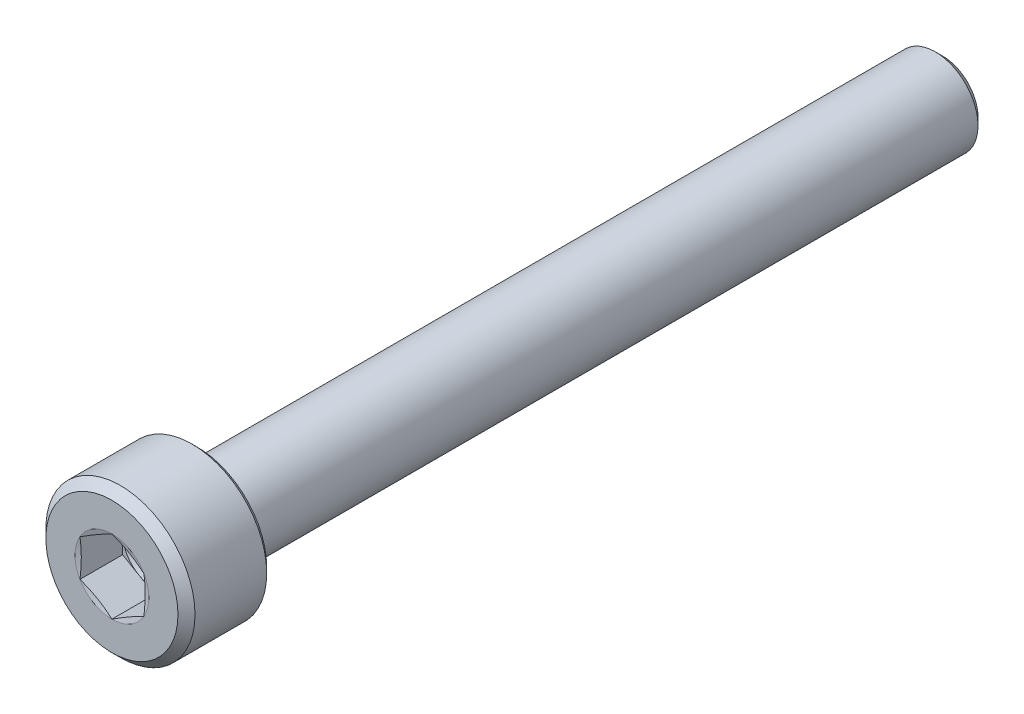
ISO-10303-21;
HEADER;
FILE_DESCRIPTION(('STEP AP214'),'2;1');
FILE_NAME('part.step','',(''),(''),'','','');
FILE_SCHEMA(('AUTOMOTIVE_DESIGN { 1 0 10303 214 1 1 1 1 }'));
ENDSEC;
DATA;
#1=APPLICATION_CONTEXT('core data for automotive mechanical design processes');
#2=APPLICATION_PROTOCOL_DEFINITION('international standard','automotive_design',2000,#1);
#3=PRODUCT_CONTEXT('',#1,'mechanical');
#4=PRODUCT('Part','Part','',(#3));
#5=PRODUCT_RELATED_PRODUCT_CATEGORY('part','',(#4));
#6=PRODUCT_DEFINITION_FORMATION('','',#4);
#7=PRODUCT_DEFINITION_CONTEXT('part definition',#1,'design');
#8=PRODUCT_DEFINITION('design','',#6,#7);
#9=PRODUCT_DEFINITION_SHAPE('','',#8);
#10=(LENGTH_UNIT() NAMED_UNIT(*) SI_UNIT(.MILLI.,.METRE.));
#11=(NAMED_UNIT(*) PLANE_ANGLE_UNIT() SI_UNIT($,.RADIAN.));
#12=(NAMED_UNIT(*) SI_UNIT($,.STERADIAN.) SOLID_ANGLE_UNIT());
#13=UNCERTAINTY_MEASURE_WITH_UNIT(LENGTH_MEASURE(1.E-05),#10,'distance_accuracy_value','');
#14=(GEOMETRIC_REPRESENTATION_CONTEXT(3) GLOBAL_UNCERTAINTY_ASSIGNED_CONTEXT((#13)) GLOBAL_UNIT_ASSIGNED_CONTEXT((#10,
#11,#12)) REPRESENTATION_CONTEXT('',''));
#15=CARTESIAN_POINT('',(0.,0.,0.));
#16=DIRECTION('',(0.,0.,1.));
#17=DIRECTION('',(1.,0.,0.));
#18=AXIS2_PLACEMENT_3D('',#15,#16,#17);
#19=CARTESIAN_POINT('',(0.,0.,0.));
#20=DIRECTION('',(0.,0.,-1.));
#21=DIRECTION('',(-1.,0.,0.));
#22=AXIS2_PLACEMENT_3D('',#19,#20,#21);
#23=PLANE('',#22);
#24=CARTESIAN_POINT('',(0.,0.,0.));
#25=DIRECTION('',(0.,0.,1.));
#26=DIRECTION('',(1.,0.,0.));
#27=AXIS2_PLACEMENT_3D('',#24,#25,#26);
#28=CIRCLE('',#27,3.1);
#29=CARTESIAN_POINT('',(3.1,0.,0.));
#30=VERTEX_POINT('',#29);
#31=EDGE_CURVE('E229',#30,#30,#28,.T.);
#32=ORIENTED_EDGE('',*,*,#31,.T.);
#33=EDGE_LOOP('',(#32));
#34=FACE_BOUND('',#33,.T.);
#35=CARTESIAN_POINT('',(0.,0.,0.));
#36=DIRECTION('',(0.,0.,1.));
#37=DIRECTION('',(1.,0.,0.));
#38=AXIS2_PLACEMENT_3D('',#35,#36,#37);
#39=CIRCLE('',#38,1.73205080756888);
#40=CARTESIAN_POINT('',(-1.5,-0.866025403784441,0.));
#41=VERTEX_POINT('',#40);
#42=CARTESIAN_POINT('',(0.,-1.73205080756888,0.));
#43=VERTEX_POINT('',#42);
#44=EDGE_CURVE('E155',#41,#43,#39,.T.);
#45=ORIENTED_EDGE('',*,*,#44,.F.);
#46=CARTESIAN_POINT('',(-1.5,0.86602540378444,0.));
#47=VERTEX_POINT('',#46);
#48=EDGE_CURVE('E154',#47,#41,#39,.T.);
#49=ORIENTED_EDGE('',*,*,#48,.F.);
#50=CARTESIAN_POINT('',(0.,1.73205080756888,0.));
#51=VERTEX_POINT('',#50);
#52=EDGE_CURVE('E121',#51,#47,#39,.T.);
#53=ORIENTED_EDGE('',*,*,#52,.F.);
#54=CARTESIAN_POINT('',(1.5,0.86602540378444,0.));
#55=VERTEX_POINT('',#54);
#56=EDGE_CURVE('E115',#55,#51,#39,.T.);
#57=ORIENTED_EDGE('',*,*,#56,.F.);
#58=CARTESIAN_POINT('',(1.5,-0.866025403784438,0.));
#59=VERTEX_POINT('',#58);
#60=EDGE_CURVE('E123',#59,#55,#39,.T.);
#61=ORIENTED_EDGE('',*,*,#60,.F.);
#62=EDGE_CURVE('E313',#43,#59,#39,.T.);
#63=ORIENTED_EDGE('',*,*,#62,.F.);
#64=EDGE_LOOP('',(#45,#49,#53,#57,#61,#63));
#65=FACE_BOUND('',#64,.T.);
#66=ADVANCED_FACE('F38',(#34,#65),#23,.F.);
#67=CARTESIAN_POINT('',(0.,0.,-0.4));
#68=DIRECTION('',(0.,0.,-1.));
#69=DIRECTION('',(-1.,0.,0.));
#70=AXIS2_PLACEMENT_3D('',#67,#68,#69);
#71=CONICAL_SURFACE('',#70,3.5,0.78539816339745);
#72=ORIENTED_EDGE('',*,*,#31,.F.);
#73=EDGE_LOOP('',(#72));
#74=FACE_BOUND('',#73,.T.);
#75=CARTESIAN_POINT('',(0.,0.,-0.4));
#76=DIRECTION('',(0.,0.,1.));
#77=DIRECTION('',(1.,0.,0.));
#78=AXIS2_PLACEMENT_3D('',#75,#76,#77);
#79=CIRCLE('',#78,3.5);
#80=CARTESIAN_POINT('',(3.5,0.,-0.4));
#81=VERTEX_POINT('',#80);
#82=EDGE_CURVE('E231',#81,#81,#79,.T.);
#83=ORIENTED_EDGE('',*,*,#82,.T.);
#84=EDGE_LOOP('',(#83));
#85=FACE_BOUND('',#84,.T.);
#86=ADVANCED_FACE('F220',(#74,#85),#71,.T.);
#87=CARTESIAN_POINT('',(0.,0.,0.));
#88=DIRECTION('',(0.,0.,1.));
#89=DIRECTION('',(1.,0.,0.));
#90=AXIS2_PLACEMENT_3D('',#87,#88,#89);
#91=CYLINDRICAL_SURFACE('',#90,3.5);
#92=ORIENTED_EDGE('',*,*,#82,.F.);
#93=EDGE_LOOP('',(#92));
#94=FACE_BOUND('',#93,.T.);
#95=CARTESIAN_POINT('',(0.,0.,-3.765));
#96=DIRECTION('',(0.,0.,1.));
#97=DIRECTION('',(1.,0.,0.));
#98=AXIS2_PLACEMENT_3D('',#95,#96,#97);
#99=CIRCLE('',#98,3.5);
#100=CARTESIAN_POINT('',(3.5,0.,-3.765));
#101=VERTEX_POINT('',#100);
#102=EDGE_CURVE('E234',#101,#101,#99,.T.);
#103=ORIENTED_EDGE('',*,*,#102,.T.);
#104=EDGE_LOOP('',(#103));
#105=FACE_BOUND('',#104,.T.);
#106=ADVANCED_FACE('F225',(#94,#105),#91,.T.);
#107=CARTESIAN_POINT('',(0.,0.,-4.));
#108=DIRECTION('',(0.,0.,1.));
#109=DIRECTION('',(1.,0.,0.));
#110=AXIS2_PLACEMENT_3D('',#107,#108,#109);
#111=CONICAL_SURFACE('',#110,3.265,0.78539816339745);
#112=ORIENTED_EDGE('',*,*,#102,.F.);
#113=EDGE_LOOP('',(#112));
#114=FACE_BOUND('',#113,.T.);
#115=CARTESIAN_POINT('',(0.,0.,-4.));
#116=DIRECTION('',(0.,0.,1.));
#117=DIRECTION('',(1.,0.,0.));
#118=AXIS2_PLACEMENT_3D('',#115,#116,#117);
#119=CIRCLE('',#118,3.265);
#120=CARTESIAN_POINT('',(3.265,0.,-4.));
#121=VERTEX_POINT('',#120);
#122=EDGE_CURVE('E239',#121,#121,#119,.T.);
#123=ORIENTED_EDGE('',*,*,#122,.T.);
#124=EDGE_LOOP('',(#123));
#125=FACE_BOUND('',#124,.T.);
#126=ADVANCED_FACE('F429',(#114,#125),#111,.T.);
#127=CARTESIAN_POINT('',(0.,3.265,-4.));
#128=DIRECTION('',(0.,0.,1.));
#129=DIRECTION('',(1.,0.,0.));
#130=AXIS2_PLACEMENT_3D('',#127,#128,#129);
#131=PLANE('',#130);
#132=ORIENTED_EDGE('',*,*,#122,.F.);
#133=EDGE_LOOP('',(#132));
#134=FACE_BOUND('',#133,.T.);
#135=CARTESIAN_POINT('',(0.,0.,-4.));
#136=DIRECTION('',(0.,0.,1.));
#137=DIRECTION('',(1.,0.,0.));
#138=AXIS2_PLACEMENT_3D('',#135,#136,#137);
#139=CIRCLE('',#138,2.35);
#140=CARTESIAN_POINT('',(2.35,0.,-4.));
#141=VERTEX_POINT('',#140);
#142=EDGE_CURVE('E242',#141,#141,#139,.T.);
#143=ORIENTED_EDGE('',*,*,#142,.T.);
#144=EDGE_LOOP('',(#143));
#145=FACE_BOUND('',#144,.T.);
#146=ADVANCED_FACE('F421',(#134,#145),#131,.F.);
#147=CARTESIAN_POINT('',(0.,0.,-4.2));
#148=DIRECTION('',(0.,0.,1.));
#149=DIRECTION('',(1.,0.,0.));
#150=AXIS2_PLACEMENT_3D('',#147,#148,#149);
#151=TOROIDAL_SURFACE('',#150,2.35,0.199999999999999);
#152=ORIENTED_EDGE('',*,*,#142,.F.);
#153=EDGE_LOOP('',(#152));
#154=FACE_BOUND('',#153,.T.);
#155=CARTESIAN_POINT('',(0.,0.,-4.12977531168232));
#156=DIRECTION('',(0.,0.,1.));
#157=DIRECTION('',(1.,0.,0.));
#158=AXIS2_PLACEMENT_3D('',#155,#156,#157);
#159=CIRCLE('',#158,2.16273416448619);
#160=CARTESIAN_POINT('',(2.16273416448619,0.,-4.12977531168232));
#161=VERTEX_POINT('',#160);
#162=EDGE_CURVE('E245',#161,#161,#159,.T.);
#163=ORIENTED_EDGE('',*,*,#162,.T.);
#164=EDGE_LOOP('',(#163));
#165=FACE_BOUND('',#164,.T.);
#166=ADVANCED_FACE('F413',(#154,#165),#151,.F.);
#167=CARTESIAN_POINT('',(0.,0.,-4.52977531168232));
#168=DIRECTION('',(0.,0.,1.));
#169=DIRECTION('',(1.,0.,0.));
#170=AXIS2_PLACEMENT_3D('',#167,#168,#169);
#171=CONICAL_SURFACE('',#170,2.01273416448619,0.358770670270571);
#172=ORIENTED_EDGE('',*,*,#162,.F.);
#173=EDGE_LOOP('',(#172));
#174=FACE_BOUND('',#173,.T.);
#175=CARTESIAN_POINT('',(0.,0.,-4.52977531168232));
#176=DIRECTION('',(0.,0.,1.));
#177=DIRECTION('',(1.,0.,0.));
#178=AXIS2_PLACEMENT_3D('',#175,#176,#177);
#179=CIRCLE('',#178,2.01273416448619);
#180=CARTESIAN_POINT('',(2.01273416448619,0.,-4.52977531168232));
#181=VERTEX_POINT('',#180);
#182=EDGE_CURVE('E248',#181,#181,#179,.T.);
#183=ORIENTED_EDGE('',*,*,#182,.T.);
#184=EDGE_LOOP('',(#183));
#185=FACE_BOUND('',#184,.T.);
#186=ADVANCED_FACE('F405',(#174,#185),#171,.T.);
#187=CARTESIAN_POINT('',(0.,0.,-4.6));
#188=DIRECTION('',(0.,0.,1.));
#189=DIRECTION('',(1.,0.,0.));
#190=AXIS2_PLACEMENT_3D('',#187,#188,#189);
#191=TOROIDAL_SURFACE('',#190,2.2,0.199999999999999);
#192=ORIENTED_EDGE('',*,*,#182,.F.);
#193=EDGE_LOOP('',(#192));
#194=FACE_BOUND('',#193,.T.);
#195=CARTESIAN_POINT('',(0.,0.,-4.6));
#196=DIRECTION('',(0.,0.,1.));
#197=DIRECTION('',(1.,0.,0.));
#198=AXIS2_PLACEMENT_3D('',#195,#196,#197);
#199=CIRCLE('',#198,2.);
#200=CARTESIAN_POINT('',(2.,0.,-4.6));
#201=VERTEX_POINT('',#200);
#202=EDGE_CURVE('E251',#201,#201,#199,.T.);
#203=ORIENTED_EDGE('',*,*,#202,.T.);
#204=EDGE_LOOP('',(#203));
#205=FACE_BOUND('',#204,.T.);
#206=ADVANCED_FACE('F397',(#194,#205),#191,.F.);
#207=CARTESIAN_POINT('',(0.,0.,0.));
#208=DIRECTION('',(0.,0.,1.));
#209=DIRECTION('',(1.,0.,0.));
#210=AXIS2_PLACEMENT_3D('',#207,#208,#209);
#211=CYLINDRICAL_SURFACE('',#210,2.);
#212=ORIENTED_EDGE('',*,*,#202,.F.);
#213=EDGE_LOOP('',(#212));
#214=FACE_BOUND('',#213,.T.);
#215=CARTESIAN_POINT('',(0.,0.,-38.65));
#216=DIRECTION('',(0.,0.,1.));
#217=DIRECTION('',(1.,0.,0.));
#218=AXIS2_PLACEMENT_3D('',#215,#216,#217);
#219=CIRCLE('',#218,2.);
#220=CARTESIAN_POINT('',(2.,0.,-38.65));
#221=VERTEX_POINT('',#220);
#222=EDGE_CURVE('E254',#221,#221,#219,.T.);
#223=ORIENTED_EDGE('',*,*,#222,.T.);
#224=EDGE_LOOP('',(#223));
#225=FACE_BOUND('',#224,.T.);
#226=ADVANCED_FACE('F388',(#214,#225),#211,.T.);
#227=CARTESIAN_POINT('',(0.,0.,-39.));
#228=DIRECTION('',(0.,0.,1.));
#229=DIRECTION('',(1.,0.,0.));
#230=AXIS2_PLACEMENT_3D('',#227,#228,#229);
#231=CONICAL_SURFACE('',#230,1.65,0.785398163397444);
#232=ORIENTED_EDGE('',*,*,#222,.F.);
#233=EDGE_LOOP('',(#232));
#234=FACE_BOUND('',#233,.T.);
#235=CARTESIAN_POINT('',(0.,0.,-39.));
#236=DIRECTION('',(0.,0.,1.));
#237=DIRECTION('',(1.,0.,0.));
#238=AXIS2_PLACEMENT_3D('',#235,#236,#237);
#239=CIRCLE('',#238,1.65);
#240=CARTESIAN_POINT('',(1.65,0.,-39.));
#241=VERTEX_POINT('',#240);
#242=EDGE_CURVE('E257',#241,#241,#239,.T.);
#243=ORIENTED_EDGE('',*,*,#242,.T.);
#244=EDGE_LOOP('',(#243));
#245=FACE_BOUND('',#244,.T.);
#246=ADVANCED_FACE('F380',(#234,#245),#231,.T.);
#247=CARTESIAN_POINT('',(0.,1.65,-39.));
#248=DIRECTION('',(0.,0.,1.));
#249=DIRECTION('',(1.,0.,0.));
#250=AXIS2_PLACEMENT_3D('',#247,#248,#249);
#251=PLANE('',#250);
#252=ORIENTED_EDGE('',*,*,#242,.F.);
#253=EDGE_LOOP('',(#252));
#254=FACE_BOUND('',#253,.T.);
#255=ADVANCED_FACE('F374',(#254),#251,.F.);
#256=CARTESIAN_POINT('',(0.,0.,-0.0621778264910692));
#257=DIRECTION('',(0.,0.,1.));
#258=DIRECTION('',(1.,0.,0.));
#259=AXIS2_PLACEMENT_3D('',#256,#257,#258);
#260=CONICAL_SURFACE('',#259,1.5,1.30899693899575);
#261=ORIENTED_EDGE('',*,*,#52,.T.);
#262=CARTESIAN_POINT('',(-1.5002,0.865909933730602,3.09432014802828E-05));
#263=CARTESIAN_POINT('',(-1.43789222061942,0.901883346928587,-0.00961367357160753));
#264=CARTESIAN_POINT('',(-1.37547144481682,0.937921998641243,-0.0183695040280942));
#265=CARTESIAN_POINT('',(-1.25040937601299,1.01012661773055,-0.0337528099860755));
#266=CARTESIAN_POINT('',(-1.18776800380528,1.04629263083708,-0.0403794203637019));
#267=CARTESIAN_POINT('',(-1.06264466889024,1.11853262193218,-0.0511173105510228));
#268=CARTESIAN_POINT('',(-1.00016355288116,1.15460611107929,-0.0552413999954297));
#269=CARTESIAN_POINT('',(-0.875121612727221,1.22679910888716,-0.0607713948192355));
#270=CARTESIAN_POINT('',(-0.81256080636361,1.26291860728191,-0.0621778264910689));
#271=CARTESIAN_POINT('',(-0.687439193636389,1.33515760407141,-0.0621778264910689));
#272=CARTESIAN_POINT('',(-0.624878387272779,1.37127710246616,-0.0607713948192355));
#273=CARTESIAN_POINT('',(-0.499836447118839,1.44347010027403,-0.0552413999954297));
#274=CARTESIAN_POINT('',(-0.437355331109757,1.47954358942114,-0.0511173105510227));
#275=CARTESIAN_POINT('',(-0.312231996194721,1.55178358051624,-0.0403794203637018));
#276=CARTESIAN_POINT('',(-0.249590623987014,1.58794959362277,-0.0337528099860754));
#277=CARTESIAN_POINT('',(-0.124528555183177,1.66015421271208,-0.0183695040280941));
#278=CARTESIAN_POINT('',(-0.0621077793805777,1.69619286442473,-0.00961367357160735));
#279=CARTESIAN_POINT('',(0.000200000000000538,1.73216627762272,3.09432014804724E-05));
#280=B_SPLINE_CURVE_WITH_KNOTS('',3,(#262,#263,#264,#265,#266,#267,#268,#269,#270,#271,#272,
#273,#274,#275,#276,#277,#278,#279),.UNSPECIFIED.,.F.,.F.,(4,2,2,2,2,2,2,2,4),(0.,
0.217782584290281,0.435653544301782,0.652399669875338,0.869103816917188,1.08580796395904,
1.30255408953259,1.52042504954409,1.73820763383438),.UNSPECIFIED.);
#281=EDGE_CURVE('E11',#47,#51,#280,.T.);
#282=ORIENTED_EDGE('',*,*,#281,.T.);
#283=EDGE_LOOP('',(#261,#282));
#284=FACE_BOUND('',#283,.T.);
#285=ADVANCED_FACE('F127',(#284),#260,.F.);
#286=CARTESIAN_POINT('',(-1.5,-2.28964517247226,0.269339250493358));
#287=CARTESIAN_POINT('',(-1.5,-2.22160925580753,0.254092485074887));
#288=CARTESIAN_POINT('',(-1.5,-2.15353089636947,0.239034964401491));
#289=CARTESIAN_POINT('',(-1.5,-2.01726808230002,0.209394014326251));
#290=CARTESIAN_POINT('',(-1.5,-1.94908362321089,0.194810605440343));
#291=CARTESIAN_POINT('',(-1.5,-1.74421629402713,0.15188930467263));
#292=CARTESIAN_POINT('',(-1.5,-1.60735081315243,0.124410160848443));
#293=CARTESIAN_POINT('',(-1.5,-1.33404872260703,0.0731505368877311));
#294=CARTESIAN_POINT('',(-1.5,-1.19761743420633,0.0493422393460058));
#295=CARTESIAN_POINT('',(-1.5,-0.923938172131804,0.00699912407182039));
#296=CARTESIAN_POINT('',(-1.5,-0.786690344875856,-0.0115366116465929));
#297=CARTESIAN_POINT('',(-1.5,-0.509744520865001,-0.0409708681025398));
#298=CARTESIAN_POINT('',(-1.5,-0.370036362636702,-0.0517807181835124));
#299=CARTESIAN_POINT('',(-1.5,-0.160199252563518,-0.0603214648098066));
#300=CARTESIAN_POINT('',(-1.5,-0.0902193139362214,-0.0618897497676771));
#301=CARTESIAN_POINT('',(-1.5,0.049751791494376,-0.0623927733659913));
#302=CARTESIAN_POINT('',(-1.5,0.119742958288953,-0.0613275140426648));
#303=CARTESIAN_POINT('',(-1.5,0.259888881116302,-0.0566175514896631));
#304=CARTESIAN_POINT('',(-1.5,0.330043318264885,-0.0529635706300794));
#305=CARTESIAN_POINT('',(-1.5,0.470190940626507,-0.0432854694959674));
#306=CARTESIAN_POINT('',(-1.5,0.540184111252621,-0.0372611426780542));
#307=CARTESIAN_POINT('',(-1.5,0.749926987666925,-0.0160904435214203));
#308=CARTESIAN_POINT('',(-1.5,0.88936353865627,0.0021504551344671));
#309=CARTESIAN_POINT('',(-1.5,1.15801626262229,0.042848348608772));
#310=CARTESIAN_POINT('',(-1.5,1.28729075030016,0.0649405727898832));
#311=CARTESIAN_POINT('',(-1.5,1.54524807848696,0.11239508941207));
#312=CARTESIAN_POINT('',(-1.5,1.67393084218421,0.137757794638382));
#313=CARTESIAN_POINT('',(-1.5,1.9308654649173,0.190676592918979));
#314=CARTESIAN_POINT('',(-1.5,2.05911723183815,0.218233127195528));
#315=CARTESIAN_POINT('',(-1.5,2.31529096225887,0.274842718879562));
#316=CARTESIAN_POINT('',(-1.5,2.44321291887911,0.303895807243219));
#317=CARTESIAN_POINT('',(-1.5,2.69755167278246,0.362760576516848));
#318=CARTESIAN_POINT('',(-1.5,2.82397086776101,0.392561944472507));
#319=CARTESIAN_POINT('',(-1.5,3.07663292781285,0.452911245733353));
#320=CARTESIAN_POINT('',(-1.5,3.20287578964328,0.483459192582276));
#321=CARTESIAN_POINT('',(-1.5,3.45507130559321,0.545068721241145));
#322=CARTESIAN_POINT('',(-1.5,3.58102412567918,0.576129625174751));
#323=CARTESIAN_POINT('',(-1.5,3.83282000513678,0.638675885363819));
#324=CARTESIAN_POINT('',(-1.5,3.95866306798554,0.670161227611327));
#325=CARTESIAN_POINT('',(-1.5,4.08446786908827,0.70179695066207));
#326=B_SPLINE_CURVE_WITH_KNOTS('',3,(#286,#287,#288,#289,#290,#291,#292,#293,#294,#295,#296,
#297,#298,#299,#300,#301,#302,#303,#304,#305,#306,#307,#308,#309,#310,#311,#312,#313,#314,#315,
#316,#317,#318,#319,#320,#321,#322,#323,#324,#325),.UNSPECIFIED.,.F.,.F.,(4,2,2,2,2,2,2,2,2,2,2,
2,2,2,2,2,2,2,2,4),(0.,0.209169579296721,0.418348197839629,0.837109447697196,1.25252230864062,
1.66786279927901,2.08789680755374,2.29784449547574,2.50779202106835,2.71849580165408,
2.92921794627363,3.35089158040197,3.74428720392395,4.13773252874107,4.53125718404496,
4.92478998266471,5.31443997631384,5.70409704388357,6.09327490648975,6.48243995615359),.UNSPECIFIED.);
#327=EDGE_CURVE('E120',#41,#47,#326,.T.);
#328=ORIENTED_EDGE('',*,*,#327,.T.);
#329=ORIENTED_EDGE('',*,*,#48,.T.);
#330=EDGE_LOOP('',(#328,#329));
#331=FACE_BOUND('',#330,.T.);
#332=ADVANCED_FACE('F361',(#331),#260,.F.);
#333=CARTESIAN_POINT('',(0.000199999999999819,-1.73216627762271,3.09432014800229E-05));
#334=CARTESIAN_POINT('',(-0.0621077793805785,-1.69619286442473,-0.00961367357160781));
#335=CARTESIAN_POINT('',(-0.124528555183178,-1.66015421271207,-0.0183695040280945));
#336=CARTESIAN_POINT('',(-0.249590623987014,-1.58794959362277,-0.0337528099860759));
#337=CARTESIAN_POINT('',(-0.312231996194721,-1.55178358051624,-0.0403794203637023));
#338=CARTESIAN_POINT('',(-0.437355331109758,-1.47954358942114,-0.0511173105510232));
#339=CARTESIAN_POINT('',(-0.499836447118839,-1.44347010027403,-0.0552413999954301));
#340=CARTESIAN_POINT('',(-0.624878387272779,-1.37127710246616,-0.0607713948192359));
#341=CARTESIAN_POINT('',(-0.68743919363639,-1.33515760407141,-0.0621778264910694));
#342=CARTESIAN_POINT('',(-0.81256080636361,-1.26291860728191,-0.0621778264910694));
#343=CARTESIAN_POINT('',(-0.875121612727221,-1.22679910888716,-0.0607713948192359));
#344=CARTESIAN_POINT('',(-1.00016355288116,-1.15460611107929,-0.0552413999954301));
#345=CARTESIAN_POINT('',(-1.06264466889024,-1.11853262193217,-0.0511173105510231));
#346=CARTESIAN_POINT('',(-1.18776800380528,-1.04629263083707,-0.0403794203637023));
#347=CARTESIAN_POINT('',(-1.25040937601299,-1.01012661773055,-0.0337528099860759));
#348=CARTESIAN_POINT('',(-1.37547144481682,-0.937921998641241,-0.0183695040280945));
#349=CARTESIAN_POINT('',(-1.43789222061942,-0.901883346928585,-0.00961367357160784));
#350=CARTESIAN_POINT('',(-1.5002,-0.8659099337306,3.09432014799995E-05));
#351=B_SPLINE_CURVE_WITH_KNOTS('',3,(#333,#334,#335,#336,#337,#338,#339,#340,#341,#342,#343,
#344,#345,#346,#347,#348,#349,#350),.UNSPECIFIED.,.F.,.F.,(4,2,2,2,2,2,2,2,4),(0.,
0.217782584290281,0.435653544301782,0.652399669875338,0.869103816917187,1.08580796395904,
1.30255408953259,1.52042504954409,1.73820763383437),.UNSPECIFIED.);
#352=EDGE_CURVE('E163',#43,#41,#351,.T.);
#353=ORIENTED_EDGE('',*,*,#352,.T.);
#354=ORIENTED_EDGE('',*,*,#44,.T.);
#355=EDGE_LOOP('',(#353,#354));
#356=FACE_BOUND('',#355,.T.);
#357=ADVANCED_FACE('F355',(#356),#260,.F.);
#358=CARTESIAN_POINT('',(1.5002,-0.865909933730601,3.09432014800545E-05));
#359=CARTESIAN_POINT('',(1.43789222061942,-0.901883346928586,-0.00961367357160779));
#360=CARTESIAN_POINT('',(1.37547144481682,-0.937921998641241,-0.0183695040280945));
#361=CARTESIAN_POINT('',(1.25040937601299,-1.01012661773055,-0.0337528099860758));
#362=CARTESIAN_POINT('',(1.18776800380528,-1.04629263083708,-0.0403794203637023));
#363=CARTESIAN_POINT('',(1.06264466889024,-1.11853262193217,-0.0511173105510231));
#364=CARTESIAN_POINT('',(1.00016355288116,-1.15460611107929,-0.0552413999954301));
#365=CARTESIAN_POINT('',(0.875121612727221,-1.22679910888716,-0.0607713948192359));
#366=CARTESIAN_POINT('',(0.81256080636361,-1.26291860728191,-0.0621778264910693));
#367=CARTESIAN_POINT('',(0.687439193636389,-1.33515760407141,-0.0621778264910693));
#368=CARTESIAN_POINT('',(0.624878387272779,-1.37127710246616,-0.0607713948192359));
#369=CARTESIAN_POINT('',(0.499836447118839,-1.44347010027403,-0.0552413999954301));
#370=CARTESIAN_POINT('',(0.437355331109758,-1.47954358942114,-0.0511173105510231));
#371=CARTESIAN_POINT('',(0.312231996194721,-1.55178358051624,-0.0403794203637023));
#372=CARTESIAN_POINT('',(0.249590623987014,-1.58794959362277,-0.0337528099860758));
#373=CARTESIAN_POINT('',(0.124528555183178,-1.66015421271207,-0.0183695040280946));
#374=CARTESIAN_POINT('',(0.0621077793805782,-1.69619286442473,-0.00961367357160789));
#375=CARTESIAN_POINT('',(-0.000200000000000048,-1.73216627762271,3.09432014798939E-05));
#376=B_SPLINE_CURVE_WITH_KNOTS('',3,(#358,#359,#360,#361,#362,#363,#364,#365,#366,#367,#368,
#369,#370,#371,#372,#373,#374,#375),.UNSPECIFIED.,.F.,.F.,(4,2,2,2,2,2,2,2,4),(0.,
0.217782584290281,0.435653544301782,0.652399669875337,0.869103816917187,1.08580796395904,
1.30255408953259,1.52042504954409,1.73820763383437),.UNSPECIFIED.);
#377=EDGE_CURVE('E183',#59,#43,#376,.T.);
#378=ORIENTED_EDGE('',*,*,#377,.T.);
#379=ORIENTED_EDGE('',*,*,#62,.T.);
#380=EDGE_LOOP('',(#378,#379));
#381=FACE_BOUND('',#380,.T.);
#382=ADVANCED_FACE('F349',(#381),#260,.F.);
#383=CARTESIAN_POINT('',(1.5,-2.28964517247227,0.269339250493358));
#384=CARTESIAN_POINT('',(1.5,-2.22160925580753,0.254092485074887));
#385=CARTESIAN_POINT('',(1.5,-2.15353089636947,0.239034964401491));
#386=CARTESIAN_POINT('',(1.5,-2.01726808230003,0.209394014326251));
#387=CARTESIAN_POINT('',(1.5,-1.94908362321089,0.194810605440343));
#388=CARTESIAN_POINT('',(1.5,-1.74421629402713,0.15188930467263));
#389=CARTESIAN_POINT('',(1.5,-1.60735081315243,0.124410160848443));
#390=CARTESIAN_POINT('',(1.5,-1.33404872260703,0.0731505368877311));
#391=CARTESIAN_POINT('',(1.5,-1.19761743420633,0.0493422393460058));
#392=CARTESIAN_POINT('',(1.5,-0.923938172131805,0.00699912407182037));
#393=CARTESIAN_POINT('',(1.5,-0.786690344875857,-0.0115366116465929));
#394=CARTESIAN_POINT('',(1.5,-0.509744520865002,-0.0409708681025397));
#395=CARTESIAN_POINT('',(1.5,-0.370036362636703,-0.0517807181835124));
#396=CARTESIAN_POINT('',(1.5,-0.160199252563519,-0.0603214648098066));
#397=CARTESIAN_POINT('',(1.5,-0.0902193139362225,-0.0618897497676772));
#398=CARTESIAN_POINT('',(1.5,0.049751791494375,-0.0623927733659914));
#399=CARTESIAN_POINT('',(1.5,0.119742958288952,-0.0613275140426649));
#400=CARTESIAN_POINT('',(1.5,0.259888881116301,-0.0566175514896632));
#401=CARTESIAN_POINT('',(1.5,0.330043318264884,-0.0529635706300795));
#402=CARTESIAN_POINT('',(1.5,0.470190940626506,-0.0432854694959675));
#403=CARTESIAN_POINT('',(1.5,0.54018411125262,-0.0372611426780543));
#404=CARTESIAN_POINT('',(1.5,0.749926987666924,-0.0160904435214204));
#405=CARTESIAN_POINT('',(1.5,0.889363538656269,0.00215045513446702));
#406=CARTESIAN_POINT('',(1.5,1.15801626262229,0.0428483486087719));
#407=CARTESIAN_POINT('',(1.5,1.28729075030016,0.0649405727898832));
#408=CARTESIAN_POINT('',(1.5,1.54524807848696,0.11239508941207));
#409=CARTESIAN_POINT('',(1.5,1.67393084218421,0.137757794638382));
#410=CARTESIAN_POINT('',(1.5,1.9308654649173,0.19067659291898));
#411=CARTESIAN_POINT('',(1.5,2.05911723183815,0.218233127195528));
#412=CARTESIAN_POINT('',(1.5,2.31529096225887,0.274842718879562));
#413=CARTESIAN_POINT('',(1.5,2.44321291887912,0.303895807243219));
#414=CARTESIAN_POINT('',(1.5,2.69755167278246,0.362760576516849));
#415=CARTESIAN_POINT('',(1.5,2.82397086776101,0.392561944472508));
#416=CARTESIAN_POINT('',(1.5,3.07663292781285,0.452911245733354));
#417=CARTESIAN_POINT('',(1.5,3.20287578964328,0.483459192582276));
#418=CARTESIAN_POINT('',(1.5,3.45507130559321,0.545068721241145));
#419=CARTESIAN_POINT('',(1.5,3.58102412567918,0.576129625174751));
#420=CARTESIAN_POINT('',(1.5,3.83282000513678,0.63867588536382));
#421=CARTESIAN_POINT('',(1.5,3.95866306798554,0.670161227611328));
#422=CARTESIAN_POINT('',(1.5,4.08446786908828,0.70179695066207));
#423=B_SPLINE_CURVE_WITH_KNOTS('',3,(#383,#384,#385,#386,#387,#388,#389,#390,#391,#392,#393,
#394,#395,#396,#397,#398,#399,#400,#401,#402,#403,#404,#405,#406,#407,#408,#409,#410,#411,#412,
#413,#414,#415,#416,#417,#418,#419,#420,#421,#422),.UNSPECIFIED.,.F.,.F.,(4,2,2,2,2,2,2,2,2,2,2,
2,2,2,2,2,2,2,2,4),(0.,0.209169579296721,0.418348197839629,0.837109447697197,1.25252230864062,
1.66786279927901,2.08789680755374,2.29784449547574,2.50779202106835,2.71849580165408,
2.92921794627363,3.35089158040197,3.74428720392395,4.13773252874107,4.53125718404496,
4.92478998266471,5.31443997631385,5.70409704388357,6.09327490648975,6.48243995615359),.UNSPECIFIED.);
#424=EDGE_CURVE('E63',#55,#59,#423,.F.);
#425=ORIENTED_EDGE('',*,*,#424,.T.);
#426=ORIENTED_EDGE('',*,*,#60,.T.);
#427=EDGE_LOOP('',(#425,#426));
#428=FACE_BOUND('',#427,.T.);
#429=ADVANCED_FACE('F176',(#428),#260,.F.);
#430=CARTESIAN_POINT('',(-0.000199999999999667,1.73216627762272,3.09432014804973E-05));
#431=CARTESIAN_POINT('',(0.0621077793805787,1.69619286442473,-0.0096136735716074));
#432=CARTESIAN_POINT('',(0.124528555183178,1.66015421271208,-0.0183695040280941));
#433=CARTESIAN_POINT('',(0.249590623987014,1.58794959362277,-0.0337528099860754));
#434=CARTESIAN_POINT('',(0.312231996194721,1.55178358051624,-0.0403794203637018));
#435=CARTESIAN_POINT('',(0.437355331109758,1.47954358942114,-0.0511173105510226));
#436=CARTESIAN_POINT('',(0.499836447118839,1.44347010027403,-0.0552413999954297));
#437=CARTESIAN_POINT('',(0.624878387272779,1.37127710246616,-0.0607713948192354));
#438=CARTESIAN_POINT('',(0.68743919363639,1.33515760407141,-0.0621778264910688));
#439=CARTESIAN_POINT('',(0.812560806363611,1.26291860728191,-0.0621778264910688));
#440=CARTESIAN_POINT('',(0.875121612727221,1.22679910888716,-0.0607713948192354));
#441=CARTESIAN_POINT('',(1.00016355288116,1.15460611107929,-0.0552413999954297));
#442=CARTESIAN_POINT('',(1.06264466889024,1.11853262193218,-0.0511173105510227));
#443=CARTESIAN_POINT('',(1.18776800380528,1.04629263083708,-0.0403794203637019));
#444=CARTESIAN_POINT('',(1.25040937601299,1.01012661773055,-0.0337528099860755));
#445=CARTESIAN_POINT('',(1.37547144481682,0.937921998641243,-0.0183695040280941));
#446=CARTESIAN_POINT('',(1.43789222061942,0.901883346928587,-0.00961367357160743));
#447=CARTESIAN_POINT('',(1.5002,0.865909933730602,3.09432014803357E-05));
#448=B_SPLINE_CURVE_WITH_KNOTS('',3,(#430,#431,#432,#433,#434,#435,#436,#437,#438,#439,#440,
#441,#442,#443,#444,#445,#446,#447),.UNSPECIFIED.,.F.,.F.,(4,2,2,2,2,2,2,2,4),(0.,
0.217782584290281,0.435653544301782,0.652399669875338,0.869103816917187,1.08580796395904,
1.30255408953259,1.52042504954409,1.73820763383437),.UNSPECIFIED.);
#449=EDGE_CURVE('E57',#51,#55,#448,.T.);
#450=ORIENTED_EDGE('',*,*,#449,.T.);
#451=ORIENTED_EDGE('',*,*,#56,.T.);
#452=EDGE_LOOP('',(#450,#451));
#453=FACE_BOUND('',#452,.T.);
#454=ADVANCED_FACE('F116',(#453),#260,.F.);
#455=CARTESIAN_POINT('',(0.,0.,-2.86602540378443));
#456=DIRECTION('',(0.,0.,1.));
#457=DIRECTION('',(1.,0.,0.));
#458=AXIS2_PLACEMENT_3D('',#455,#456,#457);
#459=CONICAL_SURFACE('',#458,0.,1.0471975511966);
#460=CARTESIAN_POINT('',(0.,0.,-2.));
#461=DIRECTION('',(0.,0.,1.));
#462=DIRECTION('',(1.,0.,0.));
#463=AXIS2_PLACEMENT_3D('',#460,#461,#462);
#464=CIRCLE('',#463,1.5);
#465=CARTESIAN_POINT('',(1.5,0.,-2.));
#466=VERTEX_POINT('',#465);
#467=CARTESIAN_POINT('',(0.75,1.29903810567666,-2.));
#468=VERTEX_POINT('',#467);
#469=EDGE_CURVE('E143',#466,#468,#464,.T.);
#470=ORIENTED_EDGE('',*,*,#469,.T.);
#471=CARTESIAN_POINT('',(-0.75,1.29903810567666,-2.));
#472=VERTEX_POINT('',#471);
#473=EDGE_CURVE('E51',#468,#472,#464,.T.);
#474=ORIENTED_EDGE('',*,*,#473,.T.);
#475=CARTESIAN_POINT('',(-1.5,0.,-2.));
#476=VERTEX_POINT('',#475);
#477=EDGE_CURVE('E294',#472,#476,#464,.T.);
#478=ORIENTED_EDGE('',*,*,#477,.T.);
#479=CARTESIAN_POINT('',(-0.75,-1.29903810567666,-2.));
#480=VERTEX_POINT('',#479);
#481=EDGE_CURVE('E296',#476,#480,#464,.T.);
#482=ORIENTED_EDGE('',*,*,#481,.T.);
#483=CARTESIAN_POINT('',(0.749999999999999,-1.29903810567666,-2.));
#484=VERTEX_POINT('',#483);
#485=EDGE_CURVE('E232',#480,#484,#464,.T.);
#486=ORIENTED_EDGE('',*,*,#485,.T.);
#487=EDGE_CURVE('E230',#484,#466,#464,.T.);
#488=ORIENTED_EDGE('',*,*,#487,.T.);
#489=EDGE_LOOP('',(#470,#474,#478,#482,#486,#488));
#490=FACE_BOUND('',#489,.T.);
#491=CARTESIAN_POINT('',(0.,0.,-2.86602540378443));
#492=VERTEX_POINT('',#491);
#493=VERTEX_LOOP('',#492);
#494=FACE_BOUND('',#493,.T.);
#495=ADVANCED_FACE('F175',(#490,#494),#459,.F.);
#496=CARTESIAN_POINT('',(0.,0.,-2.));
#497=DIRECTION('',(0.,0.,1.));
#498=DIRECTION('',(1.,0.,0.));
#499=AXIS2_PLACEMENT_3D('',#496,#497,#498);
#500=PLANE('',#499);
#501=ORIENTED_EDGE('',*,*,#469,.F.);
#502=DIRECTION('',(0.,1.,0.));
#503=VECTOR('',#502,1.);
#504=CARTESIAN_POINT('',(1.5,-0.866025403784439,-2.));
#505=LINE('',#504,#503);
#506=CARTESIAN_POINT('',(1.5,0.86602540378444,-2.));
#507=VERTEX_POINT('',#506);
#508=EDGE_CURVE('E273',#466,#507,#505,.T.);
#509=ORIENTED_EDGE('',*,*,#508,.T.);
#510=DIRECTION('',(-0.866025403784439,0.5,0.));
#511=VECTOR('',#510,1.);
#512=CARTESIAN_POINT('',(1.5,0.86602540378444,-2.));
#513=LINE('',#512,#511);
#514=EDGE_CURVE('E288',#507,#468,#513,.T.);
#515=ORIENTED_EDGE('',*,*,#514,.T.);
#516=EDGE_LOOP('',(#501,#509,#515));
#517=FACE_BOUND('',#516,.T.);
#518=ADVANCED_FACE('F318',(#517),#500,.T.);
#519=ORIENTED_EDGE('',*,*,#487,.F.);
#520=DIRECTION('',(0.866025403784439,0.5,0.));
#521=VECTOR('',#520,1.);
#522=CARTESIAN_POINT('',(0.,-1.73205080756888,-2.));
#523=LINE('',#522,#521);
#524=CARTESIAN_POINT('',(1.5,-0.866025403784439,-2.));
#525=VERTEX_POINT('',#524);
#526=EDGE_CURVE('E277',#484,#525,#523,.T.);
#527=ORIENTED_EDGE('',*,*,#526,.T.);
#528=EDGE_CURVE('E150',#525,#466,#505,.T.);
#529=ORIENTED_EDGE('',*,*,#528,.T.);
#530=EDGE_LOOP('',(#519,#527,#529));
#531=FACE_BOUND('',#530,.T.);
#532=ADVANCED_FACE('F206',(#531),#500,.T.);
#533=ORIENTED_EDGE('',*,*,#485,.F.);
#534=DIRECTION('',(0.866025403784439,-0.5,0.));
#535=VECTOR('',#534,1.);
#536=CARTESIAN_POINT('',(-1.5,-0.866025403784438,-2.));
#537=LINE('',#536,#535);
#538=CARTESIAN_POINT('',(0.,-1.73205080756888,-2.));
#539=VERTEX_POINT('',#538);
#540=EDGE_CURVE('E281',#480,#539,#537,.T.);
#541=ORIENTED_EDGE('',*,*,#540,.T.);
#542=EDGE_CURVE('E274',#539,#484,#523,.T.);
#543=ORIENTED_EDGE('',*,*,#542,.T.);
#544=EDGE_LOOP('',(#533,#541,#543));
#545=FACE_BOUND('',#544,.T.);
#546=ADVANCED_FACE('F309',(#545),#500,.T.);
#547=ORIENTED_EDGE('',*,*,#481,.F.);
#548=DIRECTION('',(0.,-1.,0.));
#549=VECTOR('',#548,1.);
#550=CARTESIAN_POINT('',(-1.5,0.86602540378444,-2.));
#551=LINE('',#550,#549);
#552=CARTESIAN_POINT('',(-1.5,-0.866025403784438,-2.));
#553=VERTEX_POINT('',#552);
#554=EDGE_CURVE('E285',#476,#553,#551,.T.);
#555=ORIENTED_EDGE('',*,*,#554,.T.);
#556=EDGE_CURVE('E278',#553,#480,#537,.T.);
#557=ORIENTED_EDGE('',*,*,#556,.T.);
#558=EDGE_LOOP('',(#547,#555,#557));
#559=FACE_BOUND('',#558,.T.);
#560=ADVANCED_FACE('F323',(#559),#500,.T.);
#561=ORIENTED_EDGE('',*,*,#473,.F.);
#562=CARTESIAN_POINT('',(0.,1.73205080756888,-2.));
#563=VERTEX_POINT('',#562);
#564=EDGE_CURVE('E290',#468,#563,#513,.T.);
#565=ORIENTED_EDGE('',*,*,#564,.T.);
#566=DIRECTION('',(-0.866025403784439,-0.5,0.));
#567=VECTOR('',#566,1.);
#568=CARTESIAN_POINT('',(0.,1.73205080756888,-2.));
#569=LINE('',#568,#567);
#570=EDGE_CURVE('E148',#563,#472,#569,.T.);
#571=ORIENTED_EDGE('',*,*,#570,.T.);
#572=EDGE_LOOP('',(#561,#565,#571));
#573=FACE_BOUND('',#572,.T.);
#574=ADVANCED_FACE('F320',(#573),#500,.T.);
#575=ORIENTED_EDGE('',*,*,#477,.F.);
#576=CARTESIAN_POINT('',(-1.5,0.86602540378444,-2.));
#577=VERTEX_POINT('',#576);
#578=EDGE_CURVE('E287',#472,#577,#569,.T.);
#579=ORIENTED_EDGE('',*,*,#578,.T.);
#580=EDGE_CURVE('E282',#577,#476,#551,.T.);
#581=ORIENTED_EDGE('',*,*,#580,.T.);
#582=EDGE_LOOP('',(#575,#579,#581));
#583=FACE_BOUND('',#582,.T.);
#584=ADVANCED_FACE('F322',(#583),#500,.T.);
#585=CARTESIAN_POINT('',(0.,1.73205080756888,-2.));
#586=DIRECTION('',(-0.5,0.866025403784439,0.));
#587=DIRECTION('',(-0.866025403784439,-0.5,0.));
#588=AXIS2_PLACEMENT_3D('',#585,#586,#587);
#589=PLANE('',#588);
#590=ORIENTED_EDGE('',*,*,#281,.F.);
#591=DIRECTION('',(0.,0.,1.));
#592=VECTOR('',#591,1.);
#593=CARTESIAN_POINT('',(-1.5,0.86602540378444,-2.));
#594=LINE('',#593,#592);
#595=EDGE_CURVE('E149',#577,#47,#594,.T.);
#596=ORIENTED_EDGE('',*,*,#595,.F.);
#597=ORIENTED_EDGE('',*,*,#578,.F.);
#598=ORIENTED_EDGE('',*,*,#570,.F.);
#599=DIRECTION('',(0.,0.,1.));
#600=VECTOR('',#599,1.);
#601=CARTESIAN_POINT('',(0.,1.73205080756888,-2.));
#602=LINE('',#601,#600);
#603=EDGE_CURVE('E138',#563,#51,#602,.T.);
#604=ORIENTED_EDGE('',*,*,#603,.T.);
#605=EDGE_LOOP('',(#590,#596,#597,#598,#604));
#606=FACE_BOUND('',#605,.T.);
#607=ADVANCED_FACE('F145',(#606),#589,.F.);
#608=CARTESIAN_POINT('',(-1.5,0.86602540378444,-2.));
#609=DIRECTION('',(-1.,0.,0.));
#610=DIRECTION('',(0.,0.,1.));
#611=AXIS2_PLACEMENT_3D('',#608,#609,#610);
#612=PLANE('',#611);
#613=ORIENTED_EDGE('',*,*,#327,.F.);
#614=DIRECTION('',(0.,0.,1.));
#615=VECTOR('',#614,1.);
#616=CARTESIAN_POINT('',(-1.5,-0.866025403784438,-2.));
#617=LINE('',#616,#615);
#618=EDGE_CURVE('E261',#553,#41,#617,.T.);
#619=ORIENTED_EDGE('',*,*,#618,.F.);
#620=ORIENTED_EDGE('',*,*,#554,.F.);
#621=ORIENTED_EDGE('',*,*,#580,.F.);
#622=ORIENTED_EDGE('',*,*,#595,.T.);
#623=EDGE_LOOP('',(#613,#619,#620,#621,#622));
#624=FACE_BOUND('',#623,.T.);
#625=ADVANCED_FACE('F170',(#624),#612,.F.);
#626=CARTESIAN_POINT('',(-1.5,-0.866025403784438,-2.));
#627=DIRECTION('',(-0.5,-0.866025403784439,0.));
#628=DIRECTION('',(0.866025403784439,-0.5,0.));
#629=AXIS2_PLACEMENT_3D('',#626,#627,#628);
#630=PLANE('',#629);
#631=ORIENTED_EDGE('',*,*,#352,.F.);
#632=DIRECTION('',(0.,0.,1.));
#633=VECTOR('',#632,1.);
#634=CARTESIAN_POINT('',(0.,-1.73205080756888,-2.));
#635=LINE('',#634,#633);
#636=EDGE_CURVE('E264',#539,#43,#635,.T.);
#637=ORIENTED_EDGE('',*,*,#636,.F.);
#638=ORIENTED_EDGE('',*,*,#540,.F.);
#639=ORIENTED_EDGE('',*,*,#556,.F.);
#640=ORIENTED_EDGE('',*,*,#618,.T.);
#641=EDGE_LOOP('',(#631,#637,#638,#639,#640));
#642=FACE_BOUND('',#641,.T.);
#643=ADVANCED_FACE('F209',(#642),#630,.F.);
#644=CARTESIAN_POINT('',(0.,-1.73205080756888,-2.));
#645=DIRECTION('',(0.5,-0.866025403784439,0.));
#646=DIRECTION('',(0.866025403784439,0.5,0.));
#647=AXIS2_PLACEMENT_3D('',#644,#645,#646);
#648=PLANE('',#647);
#649=ORIENTED_EDGE('',*,*,#377,.F.);
#650=DIRECTION('',(0.,0.,1.));
#651=VECTOR('',#650,1.);
#652=CARTESIAN_POINT('',(1.5,-0.866025403784439,-2.));
#653=LINE('',#652,#651);
#654=EDGE_CURVE('E267',#525,#59,#653,.T.);
#655=ORIENTED_EDGE('',*,*,#654,.F.);
#656=ORIENTED_EDGE('',*,*,#526,.F.);
#657=ORIENTED_EDGE('',*,*,#542,.F.);
#658=ORIENTED_EDGE('',*,*,#636,.T.);
#659=EDGE_LOOP('',(#649,#655,#656,#657,#658));
#660=FACE_BOUND('',#659,.T.);
#661=ADVANCED_FACE('F204',(#660),#648,.F.);
#662=CARTESIAN_POINT('',(1.5,-0.866025403784439,-2.));
#663=DIRECTION('',(1.,0.,0.));
#664=DIRECTION('',(0.,1.,0.));
#665=AXIS2_PLACEMENT_3D('',#662,#663,#664);
#666=PLANE('',#665);
#667=ORIENTED_EDGE('',*,*,#424,.F.);
#668=DIRECTION('',(0.,0.,1.));
#669=VECTOR('',#668,1.);
#670=CARTESIAN_POINT('',(1.5,0.86602540378444,-2.));
#671=LINE('',#670,#669);
#672=EDGE_CURVE('E142',#507,#55,#671,.T.);
#673=ORIENTED_EDGE('',*,*,#672,.F.);
#674=ORIENTED_EDGE('',*,*,#508,.F.);
#675=ORIENTED_EDGE('',*,*,#528,.F.);
#676=ORIENTED_EDGE('',*,*,#654,.T.);
#677=EDGE_LOOP('',(#667,#673,#674,#675,#676));
#678=FACE_BOUND('',#677,.T.);
#679=ADVANCED_FACE('F201',(#678),#666,.F.);
#680=CARTESIAN_POINT('',(1.5,0.86602540378444,-2.));
#681=DIRECTION('',(0.5,0.866025403784439,0.));
#682=DIRECTION('',(-0.866025403784439,0.5,0.));
#683=AXIS2_PLACEMENT_3D('',#680,#681,#682);
#684=PLANE('',#683);
#685=ORIENTED_EDGE('',*,*,#449,.F.);
#686=ORIENTED_EDGE('',*,*,#603,.F.);
#687=ORIENTED_EDGE('',*,*,#564,.F.);
#688=ORIENTED_EDGE('',*,*,#514,.F.);
#689=ORIENTED_EDGE('',*,*,#672,.T.);
#690=EDGE_LOOP('',(#685,#686,#687,#688,#689));
#691=FACE_BOUND('',#690,.T.);
#692=ADVANCED_FACE('F136',(#691),#684,.F.);
#693=CLOSED_SHELL('',(#66,#86,#106,#126,#146,#166,#186,#206,#226,#246,#255,#285,#332,#357,#382,
#429,#454,#495,#518,#532,#546,#560,#574,#584,#607,#625,#643,#661,#679,#692));
#694=MANIFOLD_SOLID_BREP('B2',#693);
#695=ADVANCED_BREP_SHAPE_REPRESENTATION('',(#18,#694),#14);
#696=SHAPE_DEFINITION_REPRESENTATION(#9,#695);
ENDSEC;
END-ISO-10303-21;
